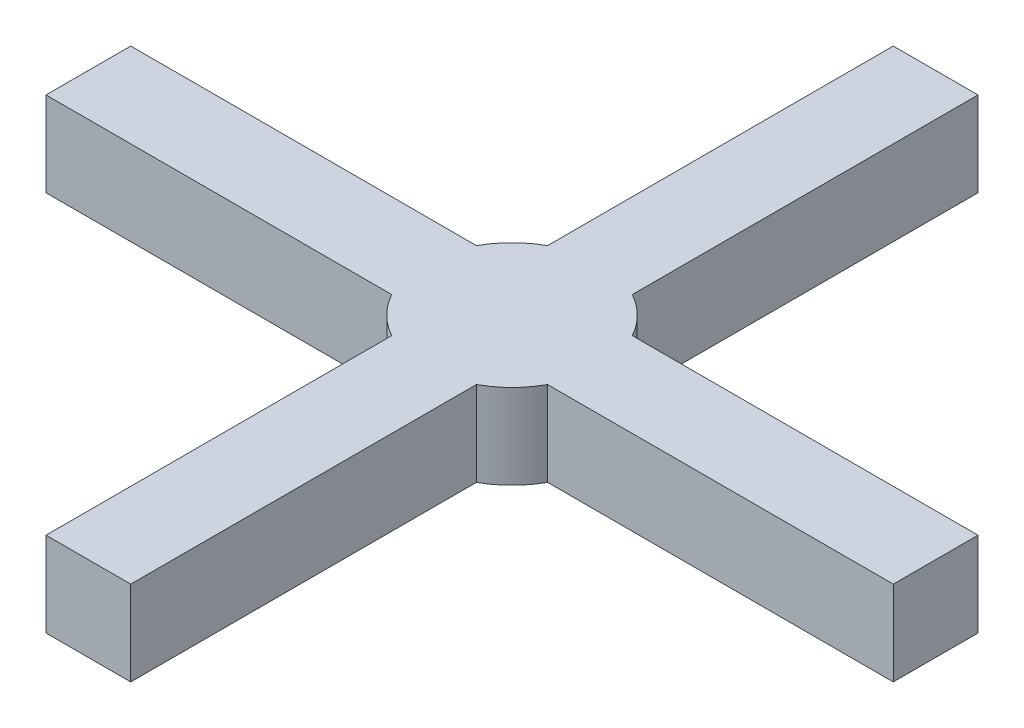
ISO-10303-21;
HEADER;
FILE_DESCRIPTION(('STEP AP214'),'2;1');
FILE_NAME('part.step','',(''),(''),'','','');
FILE_SCHEMA(('AUTOMOTIVE_DESIGN { 1 0 10303 214 1 1 1 1 }'));
ENDSEC;
DATA;
#1=APPLICATION_CONTEXT('core data for automotive mechanical design processes');
#2=APPLICATION_PROTOCOL_DEFINITION('international standard','automotive_design',2000,#1);
#3=PRODUCT_CONTEXT('',#1,'mechanical');
#4=PRODUCT('Part','Part','',(#3));
#5=PRODUCT_RELATED_PRODUCT_CATEGORY('part','',(#4));
#6=PRODUCT_DEFINITION_FORMATION('','',#4);
#7=PRODUCT_DEFINITION_CONTEXT('part definition',#1,'design');
#8=PRODUCT_DEFINITION('design','',#6,#7);
#9=PRODUCT_DEFINITION_SHAPE('','',#8);
#10=(LENGTH_UNIT() NAMED_UNIT(*) SI_UNIT(.MILLI.,.METRE.));
#11=(NAMED_UNIT(*) PLANE_ANGLE_UNIT() SI_UNIT($,.RADIAN.));
#12=(NAMED_UNIT(*) SI_UNIT($,.STERADIAN.) SOLID_ANGLE_UNIT());
#13=UNCERTAINTY_MEASURE_WITH_UNIT(LENGTH_MEASURE(1.E-05),#10,'distance_accuracy_value','');
#14=(GEOMETRIC_REPRESENTATION_CONTEXT(3) GLOBAL_UNCERTAINTY_ASSIGNED_CONTEXT((#13)) GLOBAL_UNIT_ASSIGNED_CONTEXT((#10,
#11,#12)) REPRESENTATION_CONTEXT('',''));
#15=CARTESIAN_POINT('',(0.,0.,0.));
#16=DIRECTION('',(0.,0.,1.));
#17=DIRECTION('',(1.,0.,0.));
#18=AXIS2_PLACEMENT_3D('',#15,#16,#17);
#19=CARTESIAN_POINT('',(152.4,-5410.2,280.359807763231));
#20=DIRECTION('',(1.,0.,0.));
#21=DIRECTION('',(0.,0.,-1.));
#22=AXIS2_PLACEMENT_3D('',#19,#20,#21);
#23=PLANE('',#22);
#24=DIRECTION('',(0.,0.,-1.));
#25=VECTOR('',#24,1.);
#26=CARTESIAN_POINT('',(152.4,-5105.4,280.359807763231));
#27=LINE('',#26,#25);
#28=CARTESIAN_POINT('',(152.4,-5105.4,1524.));
#29=VERTEX_POINT('',#28);
#30=CARTESIAN_POINT('',(152.4,-5105.4,280.359807763231));
#31=VERTEX_POINT('',#30);
#32=EDGE_CURVE('E178',#29,#31,#27,.T.);
#33=ORIENTED_EDGE('',*,*,#32,.F.);
#34=DIRECTION('',(0.,1.,0.));
#35=VECTOR('',#34,1.);
#36=CARTESIAN_POINT('',(152.4,-5410.2,1524.));
#37=LINE('',#36,#35);
#38=CARTESIAN_POINT('',(152.4,-5410.2,1524.));
#39=VERTEX_POINT('',#38);
#40=EDGE_CURVE('E11',#39,#29,#37,.T.);
#41=ORIENTED_EDGE('',*,*,#40,.F.);
#42=DIRECTION('',(0.,0.,-1.));
#43=VECTOR('',#42,1.);
#44=CARTESIAN_POINT('',(152.4,-5410.2,280.359807763231));
#45=LINE('',#44,#43);
#46=CARTESIAN_POINT('',(152.4,-5410.2,280.359807763231));
#47=VERTEX_POINT('',#46);
#48=EDGE_CURVE('E222',#39,#47,#45,.T.);
#49=ORIENTED_EDGE('',*,*,#48,.T.);
#50=DIRECTION('',(0.,1.,0.));
#51=VECTOR('',#50,1.);
#52=CARTESIAN_POINT('',(152.4,-5410.2,280.359807763231));
#53=LINE('',#52,#51);
#54=EDGE_CURVE('E36',#47,#31,#53,.T.);
#55=ORIENTED_EDGE('',*,*,#54,.T.);
#56=EDGE_LOOP('',(#33,#41,#49,#55));
#57=FACE_BOUND('',#56,.T.);
#58=ADVANCED_FACE('F33',(#57),#23,.T.);
#59=CARTESIAN_POINT('',(-152.4,-5410.2,1524.));
#60=DIRECTION('',(0.,0.,1.));
#61=DIRECTION('',(1.,0.,0.));
#62=AXIS2_PLACEMENT_3D('',#59,#60,#61);
#63=PLANE('',#62);
#64=DIRECTION('',(1.,0.,0.));
#65=VECTOR('',#64,1.);
#66=CARTESIAN_POINT('',(-152.4,-5105.4,1524.));
#67=LINE('',#66,#65);
#68=CARTESIAN_POINT('',(-152.4,-5105.4,1524.));
#69=VERTEX_POINT('',#68);
#70=EDGE_CURVE('E220',#69,#29,#67,.T.);
#71=ORIENTED_EDGE('',*,*,#70,.F.);
#72=DIRECTION('',(0.,1.,0.));
#73=VECTOR('',#72,1.);
#74=CARTESIAN_POINT('',(-152.4,-5410.2,1524.));
#75=LINE('',#74,#73);
#76=CARTESIAN_POINT('',(-152.4,-5410.2,1524.));
#77=VERTEX_POINT('',#76);
#78=EDGE_CURVE('E42',#77,#69,#75,.T.);
#79=ORIENTED_EDGE('',*,*,#78,.F.);
#80=DIRECTION('',(1.,0.,0.));
#81=VECTOR('',#80,1.);
#82=CARTESIAN_POINT('',(-152.4,-5410.2,1524.));
#83=LINE('',#82,#81);
#84=EDGE_CURVE('E168',#77,#39,#83,.T.);
#85=ORIENTED_EDGE('',*,*,#84,.T.);
#86=ORIENTED_EDGE('',*,*,#40,.T.);
#87=EDGE_LOOP('',(#71,#79,#85,#86));
#88=FACE_BOUND('',#87,.T.);
#89=ADVANCED_FACE('F250',(#88),#63,.T.);
#90=CARTESIAN_POINT('',(-152.4,-5410.2,280.359807763231));
#91=DIRECTION('',(-1.,0.,0.));
#92=DIRECTION('',(0.,0.,1.));
#93=AXIS2_PLACEMENT_3D('',#90,#91,#92);
#94=PLANE('',#93);
#95=DIRECTION('',(0.,0.,1.));
#96=VECTOR('',#95,1.);
#97=CARTESIAN_POINT('',(-152.4,-5105.4,280.359807763231));
#98=LINE('',#97,#96);
#99=CARTESIAN_POINT('',(-152.4,-5105.4,280.359807763231));
#100=VERTEX_POINT('',#99);
#101=EDGE_CURVE('E155',#100,#69,#98,.T.);
#102=ORIENTED_EDGE('',*,*,#101,.F.);
#103=DIRECTION('',(0.,1.,0.));
#104=VECTOR('',#103,1.);
#105=CARTESIAN_POINT('',(-152.4,-5410.2,280.359807763231));
#106=LINE('',#105,#104);
#107=CARTESIAN_POINT('',(-152.4,-5410.2,280.359807763231));
#108=VERTEX_POINT('',#107);
#109=EDGE_CURVE('E150',#108,#100,#106,.T.);
#110=ORIENTED_EDGE('',*,*,#109,.F.);
#111=DIRECTION('',(0.,0.,1.));
#112=VECTOR('',#111,1.);
#113=CARTESIAN_POINT('',(-152.4,-5410.2,280.359807763231));
#114=LINE('',#113,#112);
#115=EDGE_CURVE('E153',#108,#77,#114,.T.);
#116=ORIENTED_EDGE('',*,*,#115,.T.);
#117=ORIENTED_EDGE('',*,*,#78,.T.);
#118=EDGE_LOOP('',(#102,#110,#116,#117));
#119=FACE_BOUND('',#118,.T.);
#120=ADVANCED_FACE('F152',(#119),#94,.T.);
#121=CARTESIAN_POINT('',(0.,-5410.2,1.2490009027033E-13));
#122=DIRECTION('',(0.,1.,0.));
#123=DIRECTION('',(0.,0.,1.));
#124=AXIS2_PLACEMENT_3D('',#121,#122,#123);
#125=CYLINDRICAL_SURFACE('',#124,319.104029759945);
#126=CARTESIAN_POINT('',(0.,-5105.4,1.2490009027033E-13));
#127=DIRECTION('',(0.,1.,0.));
#128=DIRECTION('',(0.,0.,1.));
#129=AXIS2_PLACEMENT_3D('',#126,#127,#128);
#130=CIRCLE('',#129,319.104029759945);
#131=CARTESIAN_POINT('',(-280.359807763231,-5105.4,152.4));
#132=VERTEX_POINT('',#131);
#133=EDGE_CURVE('E217',#132,#100,#130,.T.);
#134=ORIENTED_EDGE('',*,*,#133,.F.);
#135=DIRECTION('',(0.,1.,0.));
#136=VECTOR('',#135,1.);
#137=CARTESIAN_POINT('',(-280.359807763231,-5410.2,152.4));
#138=LINE('',#137,#136);
#139=CARTESIAN_POINT('',(-280.359807763231,-5410.2,152.4));
#140=VERTEX_POINT('',#139);
#141=EDGE_CURVE('E160',#140,#132,#138,.T.);
#142=ORIENTED_EDGE('',*,*,#141,.F.);
#143=CARTESIAN_POINT('',(0.,-5410.2,1.2490009027033E-13));
#144=DIRECTION('',(0.,1.,0.));
#145=DIRECTION('',(0.,0.,1.));
#146=AXIS2_PLACEMENT_3D('',#143,#144,#145);
#147=CIRCLE('',#146,319.104029759945);
#148=EDGE_CURVE('E166',#140,#108,#147,.T.);
#149=ORIENTED_EDGE('',*,*,#148,.T.);
#150=ORIENTED_EDGE('',*,*,#109,.T.);
#151=EDGE_LOOP('',(#134,#142,#149,#150));
#152=FACE_BOUND('',#151,.T.);
#153=ADVANCED_FACE('F170',(#152),#125,.T.);
#154=CARTESIAN_POINT('',(-1524.,-5410.2,152.4));
#155=DIRECTION('',(0.,0.,1.));
#156=DIRECTION('',(1.,0.,0.));
#157=AXIS2_PLACEMENT_3D('',#154,#155,#156);
#158=PLANE('',#157);
#159=DIRECTION('',(1.,0.,0.));
#160=VECTOR('',#159,1.);
#161=CARTESIAN_POINT('',(-1524.,-5105.4,152.4));
#162=LINE('',#161,#160);
#163=CARTESIAN_POINT('',(-1524.,-5105.4,152.4));
#164=VERTEX_POINT('',#163);
#165=EDGE_CURVE('E214',#164,#132,#162,.T.);
#166=ORIENTED_EDGE('',*,*,#165,.F.);
#167=DIRECTION('',(0.,1.,0.));
#168=VECTOR('',#167,1.);
#169=CARTESIAN_POINT('',(-1524.,-5410.2,152.4));
#170=LINE('',#169,#168);
#171=CARTESIAN_POINT('',(-1524.,-5410.2,152.4));
#172=VERTEX_POINT('',#171);
#173=EDGE_CURVE('E226',#172,#164,#170,.T.);
#174=ORIENTED_EDGE('',*,*,#173,.F.);
#175=DIRECTION('',(1.,0.,0.));
#176=VECTOR('',#175,1.);
#177=CARTESIAN_POINT('',(-1524.,-5410.2,152.4));
#178=LINE('',#177,#176);
#179=EDGE_CURVE('E171',#172,#140,#178,.T.);
#180=ORIENTED_EDGE('',*,*,#179,.T.);
#181=ORIENTED_EDGE('',*,*,#141,.T.);
#182=EDGE_LOOP('',(#166,#174,#180,#181));
#183=FACE_BOUND('',#182,.T.);
#184=ADVANCED_FACE('F263',(#183),#158,.T.);
#185=CARTESIAN_POINT('',(-1524.,-5410.2,-152.4));
#186=DIRECTION('',(-1.,0.,0.));
#187=DIRECTION('',(0.,0.,1.));
#188=AXIS2_PLACEMENT_3D('',#185,#186,#187);
#189=PLANE('',#188);
#190=DIRECTION('',(0.,0.,1.));
#191=VECTOR('',#190,1.);
#192=CARTESIAN_POINT('',(-1524.,-5105.4,-152.4));
#193=LINE('',#192,#191);
#194=CARTESIAN_POINT('',(-1524.,-5105.4,-152.4));
#195=VERTEX_POINT('',#194);
#196=EDGE_CURVE('E211',#195,#164,#193,.T.);
#197=ORIENTED_EDGE('',*,*,#196,.F.);
#198=DIRECTION('',(0.,1.,0.));
#199=VECTOR('',#198,1.);
#200=CARTESIAN_POINT('',(-1524.,-5410.2,-152.4));
#201=LINE('',#200,#199);
#202=CARTESIAN_POINT('',(-1524.,-5410.2,-152.4));
#203=VERTEX_POINT('',#202);
#204=EDGE_CURVE('E228',#203,#195,#201,.T.);
#205=ORIENTED_EDGE('',*,*,#204,.F.);
#206=DIRECTION('',(0.,0.,1.));
#207=VECTOR('',#206,1.);
#208=CARTESIAN_POINT('',(-1524.,-5410.2,-152.4));
#209=LINE('',#208,#207);
#210=EDGE_CURVE('E173',#203,#172,#209,.T.);
#211=ORIENTED_EDGE('',*,*,#210,.T.);
#212=ORIENTED_EDGE('',*,*,#173,.T.);
#213=EDGE_LOOP('',(#197,#205,#211,#212));
#214=FACE_BOUND('',#213,.T.);
#215=ADVANCED_FACE('F266',(#214),#189,.T.);
#216=CARTESIAN_POINT('',(-1524.,-5410.2,-152.4));
#217=DIRECTION('',(0.,0.,-1.));
#218=DIRECTION('',(-1.,0.,0.));
#219=AXIS2_PLACEMENT_3D('',#216,#217,#218);
#220=PLANE('',#219);
#221=DIRECTION('',(-1.,0.,0.));
#222=VECTOR('',#221,1.);
#223=CARTESIAN_POINT('',(-1524.,-5105.4,-152.4));
#224=LINE('',#223,#222);
#225=CARTESIAN_POINT('',(-280.35980776323,-5105.4,-152.4));
#226=VERTEX_POINT('',#225);
#227=EDGE_CURVE('E208',#226,#195,#224,.T.);
#228=ORIENTED_EDGE('',*,*,#227,.F.);
#229=DIRECTION('',(0.,1.,0.));
#230=VECTOR('',#229,1.);
#231=CARTESIAN_POINT('',(-280.35980776323,-5410.2,-152.4));
#232=LINE('',#231,#230);
#233=CARTESIAN_POINT('',(-280.35980776323,-5410.2,-152.4));
#234=VERTEX_POINT('',#233);
#235=EDGE_CURVE('E230',#234,#226,#232,.T.);
#236=ORIENTED_EDGE('',*,*,#235,.F.);
#237=DIRECTION('',(-1.,0.,0.));
#238=VECTOR('',#237,1.);
#239=CARTESIAN_POINT('',(-1524.,-5410.2,-152.4));
#240=LINE('',#239,#238);
#241=EDGE_CURVE('E447',#234,#203,#240,.T.);
#242=ORIENTED_EDGE('',*,*,#241,.T.);
#243=ORIENTED_EDGE('',*,*,#204,.T.);
#244=EDGE_LOOP('',(#228,#236,#242,#243));
#245=FACE_BOUND('',#244,.T.);
#246=ADVANCED_FACE('F270',(#245),#220,.T.);
#247=CARTESIAN_POINT('',(0.,-5410.2,1.2490009027033E-13));
#248=DIRECTION('',(0.,1.,0.));
#249=DIRECTION('',(0.,0.,1.));
#250=AXIS2_PLACEMENT_3D('',#247,#248,#249);
#251=CYLINDRICAL_SURFACE('',#250,319.104029759945);
#252=CARTESIAN_POINT('',(0.,-5105.4,1.2490009027033E-13));
#253=DIRECTION('',(0.,1.,0.));
#254=DIRECTION('',(0.,0.,1.));
#255=AXIS2_PLACEMENT_3D('',#252,#253,#254);
#256=CIRCLE('',#255,319.104029759945);
#257=CARTESIAN_POINT('',(-152.4,-5105.4,-280.35980776323));
#258=VERTEX_POINT('',#257);
#259=EDGE_CURVE('E205',#258,#226,#256,.T.);
#260=ORIENTED_EDGE('',*,*,#259,.F.);
#261=DIRECTION('',(0.,1.,0.));
#262=VECTOR('',#261,1.);
#263=CARTESIAN_POINT('',(-152.4,-5410.2,-280.35980776323));
#264=LINE('',#263,#262);
#265=CARTESIAN_POINT('',(-152.4,-5410.2,-280.35980776323));
#266=VERTEX_POINT('',#265);
#267=EDGE_CURVE('E232',#266,#258,#264,.T.);
#268=ORIENTED_EDGE('',*,*,#267,.F.);
#269=CARTESIAN_POINT('',(0.,-5410.2,1.2490009027033E-13));
#270=DIRECTION('',(0.,1.,0.));
#271=DIRECTION('',(0.,0.,1.));
#272=AXIS2_PLACEMENT_3D('',#269,#270,#271);
#273=CIRCLE('',#272,319.104029759945);
#274=EDGE_CURVE('E443',#266,#234,#273,.T.);
#275=ORIENTED_EDGE('',*,*,#274,.T.);
#276=ORIENTED_EDGE('',*,*,#235,.T.);
#277=EDGE_LOOP('',(#260,#268,#275,#276));
#278=FACE_BOUND('',#277,.T.);
#279=ADVANCED_FACE('F274',(#278),#251,.T.);
#280=CARTESIAN_POINT('',(-152.4,-5410.2,-1524.));
#281=DIRECTION('',(-1.,0.,0.));
#282=DIRECTION('',(0.,0.,1.));
#283=AXIS2_PLACEMENT_3D('',#280,#281,#282);
#284=PLANE('',#283);
#285=DIRECTION('',(0.,0.,1.));
#286=VECTOR('',#285,1.);
#287=CARTESIAN_POINT('',(-152.4,-5105.4,-1524.));
#288=LINE('',#287,#286);
#289=CARTESIAN_POINT('',(-152.4,-5105.4,-1524.));
#290=VERTEX_POINT('',#289);
#291=EDGE_CURVE('E202',#290,#258,#288,.T.);
#292=ORIENTED_EDGE('',*,*,#291,.F.);
#293=DIRECTION('',(0.,1.,0.));
#294=VECTOR('',#293,1.);
#295=CARTESIAN_POINT('',(-152.4,-5410.2,-1524.));
#296=LINE('',#295,#294);
#297=CARTESIAN_POINT('',(-152.4,-5410.2,-1524.));
#298=VERTEX_POINT('',#297);
#299=EDGE_CURVE('E234',#298,#290,#296,.T.);
#300=ORIENTED_EDGE('',*,*,#299,.F.);
#301=DIRECTION('',(0.,0.,1.));
#302=VECTOR('',#301,1.);
#303=CARTESIAN_POINT('',(-152.4,-5410.2,-1524.));
#304=LINE('',#303,#302);
#305=EDGE_CURVE('E454',#298,#266,#304,.T.);
#306=ORIENTED_EDGE('',*,*,#305,.T.);
#307=ORIENTED_EDGE('',*,*,#267,.T.);
#308=EDGE_LOOP('',(#292,#300,#306,#307));
#309=FACE_BOUND('',#308,.T.);
#310=ADVANCED_FACE('F278',(#309),#284,.T.);
#311=CARTESIAN_POINT('',(-152.4,-5410.2,-1524.));
#312=DIRECTION('',(0.,0.,-1.));
#313=DIRECTION('',(-1.,0.,0.));
#314=AXIS2_PLACEMENT_3D('',#311,#312,#313);
#315=PLANE('',#314);
#316=DIRECTION('',(-1.,0.,0.));
#317=VECTOR('',#316,1.);
#318=CARTESIAN_POINT('',(-152.4,-5105.4,-1524.));
#319=LINE('',#318,#317);
#320=CARTESIAN_POINT('',(152.4,-5105.4,-1524.));
#321=VERTEX_POINT('',#320);
#322=EDGE_CURVE('E199',#321,#290,#319,.T.);
#323=ORIENTED_EDGE('',*,*,#322,.F.);
#324=DIRECTION('',(0.,1.,0.));
#325=VECTOR('',#324,1.);
#326=CARTESIAN_POINT('',(152.4,-5410.2,-1524.));
#327=LINE('',#326,#325);
#328=CARTESIAN_POINT('',(152.4,-5410.2,-1524.));
#329=VERTEX_POINT('',#328);
#330=EDGE_CURVE('E236',#329,#321,#327,.T.);
#331=ORIENTED_EDGE('',*,*,#330,.F.);
#332=DIRECTION('',(-1.,0.,0.));
#333=VECTOR('',#332,1.);
#334=CARTESIAN_POINT('',(-152.4,-5410.2,-1524.));
#335=LINE('',#334,#333);
#336=EDGE_CURVE('E436',#329,#298,#335,.T.);
#337=ORIENTED_EDGE('',*,*,#336,.T.);
#338=ORIENTED_EDGE('',*,*,#299,.T.);
#339=EDGE_LOOP('',(#323,#331,#337,#338));
#340=FACE_BOUND('',#339,.T.);
#341=ADVANCED_FACE('F282',(#340),#315,.T.);
#342=CARTESIAN_POINT('',(152.4,-5410.2,-1524.));
#343=DIRECTION('',(1.,0.,0.));
#344=DIRECTION('',(0.,0.,-1.));
#345=AXIS2_PLACEMENT_3D('',#342,#343,#344);
#346=PLANE('',#345);
#347=DIRECTION('',(0.,0.,-1.));
#348=VECTOR('',#347,1.);
#349=CARTESIAN_POINT('',(152.4,-5105.4,-1524.));
#350=LINE('',#349,#348);
#351=CARTESIAN_POINT('',(152.4,-5105.4,-280.35980776323));
#352=VERTEX_POINT('',#351);
#353=EDGE_CURVE('E196',#352,#321,#350,.T.);
#354=ORIENTED_EDGE('',*,*,#353,.F.);
#355=DIRECTION('',(0.,1.,0.));
#356=VECTOR('',#355,1.);
#357=CARTESIAN_POINT('',(152.4,-5410.2,-280.35980776323));
#358=LINE('',#357,#356);
#359=CARTESIAN_POINT('',(152.4,-5410.2,-280.35980776323));
#360=VERTEX_POINT('',#359);
#361=EDGE_CURVE('E238',#360,#352,#358,.T.);
#362=ORIENTED_EDGE('',*,*,#361,.F.);
#363=DIRECTION('',(0.,0.,-1.));
#364=VECTOR('',#363,1.);
#365=CARTESIAN_POINT('',(152.4,-5410.2,-1524.));
#366=LINE('',#365,#364);
#367=EDGE_CURVE('E432',#360,#329,#366,.T.);
#368=ORIENTED_EDGE('',*,*,#367,.T.);
#369=ORIENTED_EDGE('',*,*,#330,.T.);
#370=EDGE_LOOP('',(#354,#362,#368,#369));
#371=FACE_BOUND('',#370,.T.);
#372=ADVANCED_FACE('F286',(#371),#346,.T.);
#373=CARTESIAN_POINT('',(0.,-5410.2,1.2490009027033E-13));
#374=DIRECTION('',(0.,1.,0.));
#375=DIRECTION('',(0.,0.,1.));
#376=AXIS2_PLACEMENT_3D('',#373,#374,#375);
#377=CYLINDRICAL_SURFACE('',#376,319.104029759945);
#378=CARTESIAN_POINT('',(0.,-5105.4,1.2490009027033E-13));
#379=DIRECTION('',(0.,1.,0.));
#380=DIRECTION('',(0.,0.,1.));
#381=AXIS2_PLACEMENT_3D('',#378,#379,#380);
#382=CIRCLE('',#381,319.104029759945);
#383=CARTESIAN_POINT('',(280.359807763231,-5105.4,-152.4));
#384=VERTEX_POINT('',#383);
#385=EDGE_CURVE('E193',#384,#352,#382,.T.);
#386=ORIENTED_EDGE('',*,*,#385,.F.);
#387=DIRECTION('',(0.,1.,0.));
#388=VECTOR('',#387,1.);
#389=CARTESIAN_POINT('',(280.359807763231,-5410.2,-152.4));
#390=LINE('',#389,#388);
#391=CARTESIAN_POINT('',(280.359807763231,-5410.2,-152.4));
#392=VERTEX_POINT('',#391);
#393=EDGE_CURVE('E240',#392,#384,#390,.T.);
#394=ORIENTED_EDGE('',*,*,#393,.F.);
#395=CARTESIAN_POINT('',(0.,-5410.2,1.2490009027033E-13));
#396=DIRECTION('',(0.,1.,0.));
#397=DIRECTION('',(0.,0.,1.));
#398=AXIS2_PLACEMENT_3D('',#395,#396,#397);
#399=CIRCLE('',#398,319.104029759945);
#400=EDGE_CURVE('E458',#392,#360,#399,.T.);
#401=ORIENTED_EDGE('',*,*,#400,.T.);
#402=ORIENTED_EDGE('',*,*,#361,.T.);
#403=EDGE_LOOP('',(#386,#394,#401,#402));
#404=FACE_BOUND('',#403,.T.);
#405=ADVANCED_FACE('F290',(#404),#377,.T.);
#406=CARTESIAN_POINT('',(280.359807763231,-5410.2,-152.4));
#407=DIRECTION('',(0.,0.,-1.));
#408=DIRECTION('',(-1.,0.,0.));
#409=AXIS2_PLACEMENT_3D('',#406,#407,#408);
#410=PLANE('',#409);
#411=DIRECTION('',(-1.,0.,0.));
#412=VECTOR('',#411,1.);
#413=CARTESIAN_POINT('',(280.359807763231,-5105.4,-152.4));
#414=LINE('',#413,#412);
#415=CARTESIAN_POINT('',(1524.,-5105.4,-152.4));
#416=VERTEX_POINT('',#415);
#417=EDGE_CURVE('E190',#416,#384,#414,.T.);
#418=ORIENTED_EDGE('',*,*,#417,.F.);
#419=DIRECTION('',(0.,1.,0.));
#420=VECTOR('',#419,1.);
#421=CARTESIAN_POINT('',(1524.,-5410.2,-152.4));
#422=LINE('',#421,#420);
#423=CARTESIAN_POINT('',(1524.,-5410.2,-152.4));
#424=VERTEX_POINT('',#423);
#425=EDGE_CURVE('E242',#424,#416,#422,.T.);
#426=ORIENTED_EDGE('',*,*,#425,.F.);
#427=DIRECTION('',(-1.,0.,0.));
#428=VECTOR('',#427,1.);
#429=CARTESIAN_POINT('',(280.359807763231,-5410.2,-152.4));
#430=LINE('',#429,#428);
#431=EDGE_CURVE('E425',#424,#392,#430,.T.);
#432=ORIENTED_EDGE('',*,*,#431,.T.);
#433=ORIENTED_EDGE('',*,*,#393,.T.);
#434=EDGE_LOOP('',(#418,#426,#432,#433));
#435=FACE_BOUND('',#434,.T.);
#436=ADVANCED_FACE('F294',(#435),#410,.T.);
#437=CARTESIAN_POINT('',(1524.,-5410.2,-152.4));
#438=DIRECTION('',(1.,0.,0.));
#439=DIRECTION('',(0.,0.,-1.));
#440=AXIS2_PLACEMENT_3D('',#437,#438,#439);
#441=PLANE('',#440);
#442=DIRECTION('',(0.,0.,-1.));
#443=VECTOR('',#442,1.);
#444=CARTESIAN_POINT('',(1524.,-5105.4,-152.4));
#445=LINE('',#444,#443);
#446=CARTESIAN_POINT('',(1524.,-5105.4,152.4));
#447=VERTEX_POINT('',#446);
#448=EDGE_CURVE('E187',#447,#416,#445,.T.);
#449=ORIENTED_EDGE('',*,*,#448,.F.);
#450=DIRECTION('',(0.,1.,0.));
#451=VECTOR('',#450,1.);
#452=CARTESIAN_POINT('',(1524.,-5410.2,152.4));
#453=LINE('',#452,#451);
#454=CARTESIAN_POINT('',(1524.,-5410.2,152.4));
#455=VERTEX_POINT('',#454);
#456=EDGE_CURVE('E244',#455,#447,#453,.T.);
#457=ORIENTED_EDGE('',*,*,#456,.F.);
#458=DIRECTION('',(0.,0.,-1.));
#459=VECTOR('',#458,1.);
#460=CARTESIAN_POINT('',(1524.,-5410.2,-152.4));
#461=LINE('',#460,#459);
#462=EDGE_CURVE('E421',#455,#424,#461,.T.);
#463=ORIENTED_EDGE('',*,*,#462,.T.);
#464=ORIENTED_EDGE('',*,*,#425,.T.);
#465=EDGE_LOOP('',(#449,#457,#463,#464));
#466=FACE_BOUND('',#465,.T.);
#467=ADVANCED_FACE('F298',(#466),#441,.T.);
#468=CARTESIAN_POINT('',(280.359807763231,-5410.2,152.4));
#469=DIRECTION('',(0.,0.,1.));
#470=DIRECTION('',(1.,0.,0.));
#471=AXIS2_PLACEMENT_3D('',#468,#469,#470);
#472=PLANE('',#471);
#473=DIRECTION('',(1.,0.,0.));
#474=VECTOR('',#473,1.);
#475=CARTESIAN_POINT('',(280.359807763231,-5105.4,152.4));
#476=LINE('',#475,#474);
#477=CARTESIAN_POINT('',(280.359807763231,-5105.4,152.4));
#478=VERTEX_POINT('',#477);
#479=EDGE_CURVE('E184',#478,#447,#476,.T.);
#480=ORIENTED_EDGE('',*,*,#479,.F.);
#481=DIRECTION('',(0.,1.,0.));
#482=VECTOR('',#481,1.);
#483=CARTESIAN_POINT('',(280.359807763231,-5410.2,152.4));
#484=LINE('',#483,#482);
#485=CARTESIAN_POINT('',(280.359807763231,-5410.2,152.4));
#486=VERTEX_POINT('',#485);
#487=EDGE_CURVE('E245',#486,#478,#484,.T.);
#488=ORIENTED_EDGE('',*,*,#487,.F.);
#489=DIRECTION('',(1.,0.,0.));
#490=VECTOR('',#489,1.);
#491=CARTESIAN_POINT('',(280.359807763231,-5410.2,152.4));
#492=LINE('',#491,#490);
#493=EDGE_CURVE('E462',#486,#455,#492,.T.);
#494=ORIENTED_EDGE('',*,*,#493,.T.);
#495=ORIENTED_EDGE('',*,*,#456,.T.);
#496=EDGE_LOOP('',(#480,#488,#494,#495));
#497=FACE_BOUND('',#496,.T.);
#498=ADVANCED_FACE('F302',(#497),#472,.T.);
#499=CARTESIAN_POINT('',(0.,-5410.2,1.2490009027033E-13));
#500=DIRECTION('',(0.,1.,0.));
#501=DIRECTION('',(0.,0.,1.));
#502=AXIS2_PLACEMENT_3D('',#499,#500,#501);
#503=CYLINDRICAL_SURFACE('',#502,319.104029759945);
#504=CARTESIAN_POINT('',(0.,-5105.4,1.2490009027033E-13));
#505=DIRECTION('',(0.,1.,0.));
#506=DIRECTION('',(0.,0.,1.));
#507=AXIS2_PLACEMENT_3D('',#504,#505,#506);
#508=CIRCLE('',#507,319.104029759945);
#509=EDGE_CURVE('E181',#31,#478,#508,.T.);
#510=ORIENTED_EDGE('',*,*,#509,.F.);
#511=ORIENTED_EDGE('',*,*,#54,.F.);
#512=CARTESIAN_POINT('',(0.,-5410.2,1.2490009027033E-13));
#513=DIRECTION('',(0.,1.,0.));
#514=DIRECTION('',(0.,0.,1.));
#515=AXIS2_PLACEMENT_3D('',#512,#513,#514);
#516=CIRCLE('',#515,319.104029759945);
#517=EDGE_CURVE('E464',#47,#486,#516,.T.);
#518=ORIENTED_EDGE('',*,*,#517,.T.);
#519=ORIENTED_EDGE('',*,*,#487,.T.);
#520=EDGE_LOOP('',(#510,#511,#518,#519));
#521=FACE_BOUND('',#520,.T.);
#522=ADVANCED_FACE('F247',(#521),#503,.T.);
#523=CARTESIAN_POINT('',(0.,-5410.2,1.2490009027033E-13));
#524=DIRECTION('',(0.,1.,0.));
#525=DIRECTION('',(0.,0.,1.));
#526=AXIS2_PLACEMENT_3D('',#523,#524,#525);
#527=PLANE('',#526);
#528=ORIENTED_EDGE('',*,*,#48,.F.);
#529=ORIENTED_EDGE('',*,*,#84,.F.);
#530=ORIENTED_EDGE('',*,*,#115,.F.);
#531=ORIENTED_EDGE('',*,*,#148,.F.);
#532=ORIENTED_EDGE('',*,*,#179,.F.);
#533=ORIENTED_EDGE('',*,*,#210,.F.);
#534=ORIENTED_EDGE('',*,*,#241,.F.);
#535=ORIENTED_EDGE('',*,*,#274,.F.);
#536=ORIENTED_EDGE('',*,*,#305,.F.);
#537=ORIENTED_EDGE('',*,*,#336,.F.);
#538=ORIENTED_EDGE('',*,*,#367,.F.);
#539=ORIENTED_EDGE('',*,*,#400,.F.);
#540=ORIENTED_EDGE('',*,*,#431,.F.);
#541=ORIENTED_EDGE('',*,*,#462,.F.);
#542=ORIENTED_EDGE('',*,*,#493,.F.);
#543=ORIENTED_EDGE('',*,*,#517,.F.);
#544=EDGE_LOOP('',(#528,#529,#530,#531,#532,#533,#534,#535,#536,#537,#538,#539,#540,#541,#542,#543));
#545=FACE_BOUND('',#544,.T.);
#546=ADVANCED_FACE('F164',(#545),#527,.F.);
#547=CARTESIAN_POINT('',(0.,-5105.4,1.2490009027033E-13));
#548=DIRECTION('',(0.,1.,0.));
#549=DIRECTION('',(0.,0.,1.));
#550=AXIS2_PLACEMENT_3D('',#547,#548,#549);
#551=PLANE('',#550);
#552=ORIENTED_EDGE('',*,*,#32,.T.);
#553=ORIENTED_EDGE('',*,*,#509,.T.);
#554=ORIENTED_EDGE('',*,*,#479,.T.);
#555=ORIENTED_EDGE('',*,*,#448,.T.);
#556=ORIENTED_EDGE('',*,*,#417,.T.);
#557=ORIENTED_EDGE('',*,*,#385,.T.);
#558=ORIENTED_EDGE('',*,*,#353,.T.);
#559=ORIENTED_EDGE('',*,*,#322,.T.);
#560=ORIENTED_EDGE('',*,*,#291,.T.);
#561=ORIENTED_EDGE('',*,*,#259,.T.);
#562=ORIENTED_EDGE('',*,*,#227,.T.);
#563=ORIENTED_EDGE('',*,*,#196,.T.);
#564=ORIENTED_EDGE('',*,*,#165,.T.);
#565=ORIENTED_EDGE('',*,*,#133,.T.);
#566=ORIENTED_EDGE('',*,*,#101,.T.);
#567=ORIENTED_EDGE('',*,*,#70,.T.);
#568=EDGE_LOOP('',(#552,#553,#554,#555,#556,#557,#558,#559,#560,#561,#562,#563,#564,#565,#566,#567));
#569=FACE_BOUND('',#568,.T.);
#570=ADVANCED_FACE('F249',(#569),#551,.T.);
#571=CLOSED_SHELL('',(#58,#89,#120,#153,#184,#215,#246,#279,#310,#341,#372,#405,#436,#467,#498,
#522,#546,#570));
#572=MANIFOLD_SOLID_BREP('B2',#571);
#573=ADVANCED_BREP_SHAPE_REPRESENTATION('',(#18,#572),#14);
#574=SHAPE_DEFINITION_REPRESENTATION(#9,#573);
ENDSEC;
END-ISO-10303-21;
